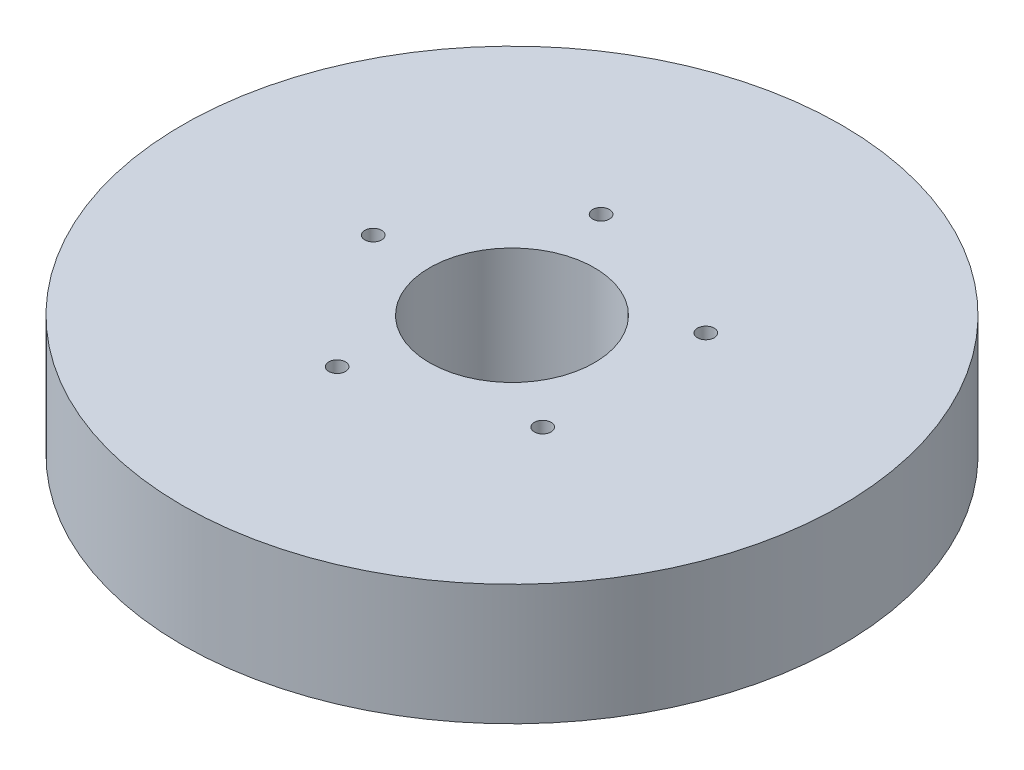
ISO-10303-21;
HEADER;
FILE_DESCRIPTION(('STEP AP214'),'2;1');
FILE_NAME('part.step','',(''),(''),'','','');
FILE_SCHEMA(('AUTOMOTIVE_DESIGN { 1 0 10303 214 1 1 1 1 }'));
ENDSEC;
DATA;
#1=APPLICATION_CONTEXT('core data for automotive mechanical design processes');
#2=APPLICATION_PROTOCOL_DEFINITION('international standard','automotive_design',2000,#1);
#3=PRODUCT_CONTEXT('',#1,'mechanical');
#4=PRODUCT('Part','Part','',(#3));
#5=PRODUCT_RELATED_PRODUCT_CATEGORY('part','',(#4));
#6=PRODUCT_DEFINITION_FORMATION('','',#4);
#7=PRODUCT_DEFINITION_CONTEXT('part definition',#1,'design');
#8=PRODUCT_DEFINITION('design','',#6,#7);
#9=PRODUCT_DEFINITION_SHAPE('','',#8);
#10=(LENGTH_UNIT() NAMED_UNIT(*) SI_UNIT(.MILLI.,.METRE.));
#11=(NAMED_UNIT(*) PLANE_ANGLE_UNIT() SI_UNIT($,.RADIAN.));
#12=(NAMED_UNIT(*) SI_UNIT($,.STERADIAN.) SOLID_ANGLE_UNIT());
#13=UNCERTAINTY_MEASURE_WITH_UNIT(LENGTH_MEASURE(1.E-05),#10,'distance_accuracy_value','');
#14=(GEOMETRIC_REPRESENTATION_CONTEXT(3) GLOBAL_UNCERTAINTY_ASSIGNED_CONTEXT((#13)) GLOBAL_UNIT_ASSIGNED_CONTEXT((#10,
#11,#12)) REPRESENTATION_CONTEXT('',''));
#15=CARTESIAN_POINT('',(0.,0.,0.));
#16=DIRECTION('',(0.,0.,1.));
#17=DIRECTION('',(1.,0.,0.));
#18=AXIS2_PLACEMENT_3D('',#15,#16,#17);
#19=CARTESIAN_POINT('',(0.,22.,0.));
#20=DIRECTION('',(0.,-1.,0.));
#21=DIRECTION('',(0.,0.,-1.));
#22=AXIS2_PLACEMENT_3D('',#19,#20,#21);
#23=CYLINDRICAL_SURFACE('',#22,60.);
#24=CARTESIAN_POINT('',(0.,22.,0.));
#25=DIRECTION('',(0.,1.,0.));
#26=DIRECTION('',(0.,0.,1.));
#27=AXIS2_PLACEMENT_3D('',#24,#25,#26);
#28=CIRCLE('',#27,60.);
#29=CARTESIAN_POINT('',(0.,22.,60.));
#30=VERTEX_POINT('',#29);
#31=EDGE_CURVE('E10',#30,#30,#28,.T.);
#32=ORIENTED_EDGE('',*,*,#31,.F.);
#33=EDGE_LOOP('',(#32));
#34=FACE_BOUND('',#33,.T.);
#35=CARTESIAN_POINT('',(0.,0.,0.));
#36=DIRECTION('',(0.,1.,0.));
#37=DIRECTION('',(0.,0.,1.));
#38=AXIS2_PLACEMENT_3D('',#35,#36,#37);
#39=CIRCLE('',#38,60.);
#40=CARTESIAN_POINT('',(0.,0.,60.));
#41=VERTEX_POINT('',#40);
#42=EDGE_CURVE('E37',#41,#41,#39,.T.);
#43=ORIENTED_EDGE('',*,*,#42,.T.);
#44=EDGE_LOOP('',(#43));
#45=FACE_BOUND('',#44,.T.);
#46=ADVANCED_FACE('F40',(#34,#45),#23,.T.);
#47=CARTESIAN_POINT('',(0.,22.,0.));
#48=DIRECTION('',(0.,1.,0.));
#49=DIRECTION('',(0.,0.,1.));
#50=AXIS2_PLACEMENT_3D('',#47,#48,#49);
#51=PLANE('',#50);
#52=CARTESIAN_POINT('',(-7.80661225066631,22.,24.0262820049866));
#53=DIRECTION('',(0.,1.,0.));
#54=DIRECTION('',(0.951056516295155,0.,0.309016994374945));
#55=AXIS2_PLACEMENT_3D('',#52,#53,#54);
#56=CIRCLE('',#55,1.52617574658441);
#57=CARTESIAN_POINT('',(-6.35513286186558,22.,24.497896247084));
#58=VERTEX_POINT('',#57);
#59=EDGE_CURVE('E78',#58,#58,#56,.T.);
#60=ORIENTED_EDGE('',*,*,#59,.F.);
#61=EDGE_LOOP('',(#60));
#62=FACE_BOUND('',#61,.T.);
#63=CARTESIAN_POINT('',(20.437976209236,22.,14.8490589023716));
#64=DIRECTION('',(0.,1.,0.));
#65=DIRECTION('',(0.587785252292469,0.,-0.809016994374951));
#66=AXIS2_PLACEMENT_3D('',#63,#64,#65);
#67=CIRCLE('',#66,1.52617574658441);
#68=CARTESIAN_POINT('',(21.3350398054847,22.,13.6143567869819));
#69=VERTEX_POINT('',#68);
#70=EDGE_CURVE('E71',#69,#69,#67,.T.);
#71=ORIENTED_EDGE('',*,*,#70,.F.);
#72=EDGE_LOOP('',(#71));
#73=FACE_BOUND('',#72,.T.);
#74=CARTESIAN_POINT('',(20.4379762092358,22.,-14.8490589023718));
#75=DIRECTION('',(0.,1.,0.));
#76=DIRECTION('',(-0.58778525229248,0.,-0.809016994374942));
#77=AXIS2_PLACEMENT_3D('',#74,#75,#76);
#78=CIRCLE('',#77,1.52617574658441);
#79=CARTESIAN_POINT('',(19.540912612987,22.,-16.0837610177615));
#80=VERTEX_POINT('',#79);
#81=EDGE_CURVE('E70',#80,#80,#78,.T.);
#82=ORIENTED_EDGE('',*,*,#81,.F.);
#83=EDGE_LOOP('',(#82));
#84=FACE_BOUND('',#83,.T.);
#85=CARTESIAN_POINT('',(-7.80661225066665,22.,-24.0262820049865));
#86=DIRECTION('',(0.,1.,0.));
#87=DIRECTION('',(-0.95105651629515,0.,0.309016994374958));
#88=AXIS2_PLACEMENT_3D('',#85,#86,#87);
#89=CIRCLE('',#88,1.52617574658441);
#90=CARTESIAN_POINT('',(-9.25809163946737,22.,-23.554667762889));
#91=VERTEX_POINT('',#90);
#92=EDGE_CURVE('E61',#91,#91,#89,.T.);
#93=ORIENTED_EDGE('',*,*,#92,.F.);
#94=EDGE_LOOP('',(#93));
#95=FACE_BOUND('',#94,.T.);
#96=CARTESIAN_POINT('',(-25.262727917139,22.,0.));
#97=DIRECTION('',(0.,1.,0.));
#98=DIRECTION('',(0.,0.,1.));
#99=AXIS2_PLACEMENT_3D('',#96,#97,#98);
#100=CIRCLE('',#99,1.52617574658441);
#101=CARTESIAN_POINT('',(-25.262727917139,22.,1.52617574658441));
#102=VERTEX_POINT('',#101);
#103=EDGE_CURVE('E54',#102,#102,#100,.T.);
#104=ORIENTED_EDGE('',*,*,#103,.F.);
#105=EDGE_LOOP('',(#104));
#106=FACE_BOUND('',#105,.T.);
#107=CARTESIAN_POINT('',(0.,22.,0.));
#108=DIRECTION('',(0.,1.,0.));
#109=DIRECTION('',(0.,0.,1.));
#110=AXIS2_PLACEMENT_3D('',#107,#108,#109);
#111=CIRCLE('',#110,15.);
#112=CARTESIAN_POINT('',(0.,22.,15.));
#113=VERTEX_POINT('',#112);
#114=EDGE_CURVE('E50',#113,#113,#111,.T.);
#115=ORIENTED_EDGE('',*,*,#114,.F.);
#116=EDGE_LOOP('',(#115));
#117=FACE_BOUND('',#116,.T.);
#118=ORIENTED_EDGE('',*,*,#31,.T.);
#119=EDGE_LOOP('',(#118));
#120=FACE_BOUND('',#119,.T.);
#121=ADVANCED_FACE('F94',(#62,#73,#84,#95,#106,#117,#120),#51,.T.);
#122=CARTESIAN_POINT('',(0.,0.,0.));
#123=DIRECTION('',(0.,1.,0.));
#124=DIRECTION('',(0.,0.,1.));
#125=AXIS2_PLACEMENT_3D('',#122,#123,#124);
#126=PLANE('',#125);
#127=CARTESIAN_POINT('',(0.,0.,0.));
#128=DIRECTION('',(0.,1.,0.));
#129=DIRECTION('',(0.,0.,1.));
#130=AXIS2_PLACEMENT_3D('',#127,#128,#129);
#131=CIRCLE('',#130,15.);
#132=CARTESIAN_POINT('',(0.,0.,15.));
#133=VERTEX_POINT('',#132);
#134=EDGE_CURVE('E47',#133,#133,#131,.T.);
#135=ORIENTED_EDGE('',*,*,#134,.T.);
#136=EDGE_LOOP('',(#135));
#137=FACE_BOUND('',#136,.T.);
#138=ORIENTED_EDGE('',*,*,#42,.F.);
#139=EDGE_LOOP('',(#138));
#140=FACE_BOUND('',#139,.T.);
#141=ADVANCED_FACE('F100',(#137,#140),#126,.F.);
#142=CARTESIAN_POINT('',(0.,22.,0.));
#143=DIRECTION('',(0.,-1.,0.));
#144=DIRECTION('',(0.,0.,-1.));
#145=AXIS2_PLACEMENT_3D('',#142,#143,#144);
#146=CYLINDRICAL_SURFACE('',#145,15.);
#147=ORIENTED_EDGE('',*,*,#114,.T.);
#148=EDGE_LOOP('',(#147));
#149=FACE_BOUND('',#148,.T.);
#150=ORIENTED_EDGE('',*,*,#134,.F.);
#151=EDGE_LOOP('',(#150));
#152=FACE_BOUND('',#151,.T.);
#153=ADVANCED_FACE('F108',(#149,#152),#146,.F.);
#154=CARTESIAN_POINT('',(-25.262727917139,8.06643174136733,0.));
#155=DIRECTION('',(0.,1.,0.));
#156=DIRECTION('',(0.,0.,1.));
#157=AXIS2_PLACEMENT_3D('',#154,#155,#156);
#158=CYLINDRICAL_SURFACE('',#157,1.52617574658441);
#159=CARTESIAN_POINT('',(-25.262727917139,8.06643174136733,0.));
#160=DIRECTION('',(0.,1.,0.));
#161=DIRECTION('',(0.,0.,1.));
#162=AXIS2_PLACEMENT_3D('',#159,#160,#161);
#163=CIRCLE('',#162,1.52617574658441);
#164=CARTESIAN_POINT('',(-25.262727917139,8.06643174136733,1.52617574658441));
#165=VERTEX_POINT('',#164);
#166=EDGE_CURVE('E55',#165,#165,#163,.T.);
#167=ORIENTED_EDGE('',*,*,#166,.F.);
#168=EDGE_LOOP('',(#167));
#169=FACE_BOUND('',#168,.T.);
#170=ORIENTED_EDGE('',*,*,#103,.T.);
#171=EDGE_LOOP('',(#170));
#172=FACE_BOUND('',#171,.T.);
#173=ADVANCED_FACE('F115',(#169,#172),#158,.F.);
#174=CARTESIAN_POINT('',(-25.262727917139,8.06643174136733,0.));
#175=DIRECTION('',(0.,1.,0.));
#176=DIRECTION('',(0.,0.,1.));
#177=AXIS2_PLACEMENT_3D('',#174,#175,#176);
#178=PLANE('',#177);
#179=ORIENTED_EDGE('',*,*,#166,.T.);
#180=EDGE_LOOP('',(#179));
#181=FACE_BOUND('',#180,.T.);
#182=ADVANCED_FACE('F142',(#181),#178,.T.);
#183=CARTESIAN_POINT('',(-7.80661225066665,8.06643174136733,-24.0262820049865));
#184=DIRECTION('',(0.,1.,0.));
#185=DIRECTION('',(0.,0.,1.));
#186=AXIS2_PLACEMENT_3D('',#183,#184,#185);
#187=CYLINDRICAL_SURFACE('',#186,1.52617574658441);
#188=CARTESIAN_POINT('',(-7.80661225066665,8.06643174136733,-24.0262820049865));
#189=DIRECTION('',(0.,1.,0.));
#190=DIRECTION('',(-0.95105651629515,0.,0.309016994374958));
#191=AXIS2_PLACEMENT_3D('',#188,#189,#190);
#192=CIRCLE('',#191,1.52617574658441);
#193=CARTESIAN_POINT('',(-9.25809163946737,8.06643174136733,-23.554667762889));
#194=VERTEX_POINT('',#193);
#195=EDGE_CURVE('E63',#194,#194,#192,.T.);
#196=ORIENTED_EDGE('',*,*,#195,.F.);
#197=EDGE_LOOP('',(#196));
#198=FACE_BOUND('',#197,.T.);
#199=ORIENTED_EDGE('',*,*,#92,.T.);
#200=EDGE_LOOP('',(#199));
#201=FACE_BOUND('',#200,.T.);
#202=ADVANCED_FACE('F147',(#198,#201),#187,.F.);
#203=CARTESIAN_POINT('',(-7.80661225066665,8.06643174136733,-24.0262820049865));
#204=DIRECTION('',(0.,1.,0.));
#205=DIRECTION('',(-0.95105651629515,0.,0.309016994374958));
#206=AXIS2_PLACEMENT_3D('',#203,#204,#205);
#207=PLANE('',#206);
#208=ORIENTED_EDGE('',*,*,#195,.T.);
#209=EDGE_LOOP('',(#208));
#210=FACE_BOUND('',#209,.T.);
#211=ADVANCED_FACE('F163',(#210),#207,.T.);
#212=CARTESIAN_POINT('',(20.4379762092358,8.06643174136733,-14.8490589023718));
#213=DIRECTION('',(0.,1.,0.));
#214=DIRECTION('',(0.,0.,1.));
#215=AXIS2_PLACEMENT_3D('',#212,#213,#214);
#216=CYLINDRICAL_SURFACE('',#215,1.52617574658441);
#217=CARTESIAN_POINT('',(20.4379762092358,8.06643174136733,-14.8490589023718));
#218=DIRECTION('',(0.,1.,0.));
#219=DIRECTION('',(-0.58778525229248,0.,-0.809016994374942));
#220=AXIS2_PLACEMENT_3D('',#217,#218,#219);
#221=CIRCLE('',#220,1.52617574658441);
#222=CARTESIAN_POINT('',(19.540912612987,8.06643174136733,-16.0837610177615));
#223=VERTEX_POINT('',#222);
#224=EDGE_CURVE('E69',#223,#223,#221,.T.);
#225=ORIENTED_EDGE('',*,*,#224,.F.);
#226=EDGE_LOOP('',(#225));
#227=FACE_BOUND('',#226,.T.);
#228=ORIENTED_EDGE('',*,*,#81,.T.);
#229=EDGE_LOOP('',(#228));
#230=FACE_BOUND('',#229,.T.);
#231=ADVANCED_FACE('F172',(#227,#230),#216,.F.);
#232=CARTESIAN_POINT('',(20.4379762092358,8.06643174136733,-14.8490589023718));
#233=DIRECTION('',(0.,1.,0.));
#234=DIRECTION('',(-0.58778525229248,0.,-0.809016994374942));
#235=AXIS2_PLACEMENT_3D('',#232,#233,#234);
#236=PLANE('',#235);
#237=ORIENTED_EDGE('',*,*,#224,.T.);
#238=EDGE_LOOP('',(#237));
#239=FACE_BOUND('',#238,.T.);
#240=ADVANCED_FACE('F185',(#239),#236,.T.);
#241=CARTESIAN_POINT('',(20.437976209236,8.06643174136733,14.8490589023716));
#242=DIRECTION('',(0.,1.,0.));
#243=DIRECTION('',(0.,0.,1.));
#244=AXIS2_PLACEMENT_3D('',#241,#242,#243);
#245=CYLINDRICAL_SURFACE('',#244,1.52617574658441);
#246=CARTESIAN_POINT('',(20.437976209236,8.06643174136733,14.8490589023716));
#247=DIRECTION('',(0.,1.,0.));
#248=DIRECTION('',(0.587785252292469,0.,-0.809016994374951));
#249=AXIS2_PLACEMENT_3D('',#246,#247,#248);
#250=CIRCLE('',#249,1.52617574658441);
#251=CARTESIAN_POINT('',(21.3350398054847,8.06643174136733,13.6143567869819));
#252=VERTEX_POINT('',#251);
#253=EDGE_CURVE('E76',#252,#252,#250,.T.);
#254=ORIENTED_EDGE('',*,*,#253,.F.);
#255=EDGE_LOOP('',(#254));
#256=FACE_BOUND('',#255,.T.);
#257=ORIENTED_EDGE('',*,*,#70,.T.);
#258=EDGE_LOOP('',(#257));
#259=FACE_BOUND('',#258,.T.);
#260=ADVANCED_FACE('F191',(#256,#259),#245,.F.);
#261=CARTESIAN_POINT('',(20.437976209236,8.06643174136733,14.8490589023716));
#262=DIRECTION('',(0.,1.,0.));
#263=DIRECTION('',(0.587785252292469,0.,-0.809016994374951));
#264=AXIS2_PLACEMENT_3D('',#261,#262,#263);
#265=PLANE('',#264);
#266=ORIENTED_EDGE('',*,*,#253,.T.);
#267=EDGE_LOOP('',(#266));
#268=FACE_BOUND('',#267,.T.);
#269=ADVANCED_FACE('F89',(#268),#265,.T.);
#270=CARTESIAN_POINT('',(-7.80661225066631,8.06643174136733,24.0262820049866));
#271=DIRECTION('',(0.,1.,0.));
#272=DIRECTION('',(0.,0.,1.));
#273=AXIS2_PLACEMENT_3D('',#270,#271,#272);
#274=CYLINDRICAL_SURFACE('',#273,1.52617574658441);
#275=CARTESIAN_POINT('',(-7.80661225066631,8.06643174136733,24.0262820049866));
#276=DIRECTION('',(0.,1.,0.));
#277=DIRECTION('',(0.951056516295155,0.,0.309016994374945));
#278=AXIS2_PLACEMENT_3D('',#275,#276,#277);
#279=CIRCLE('',#278,1.52617574658441);
#280=CARTESIAN_POINT('',(-6.35513286186558,8.06643174136733,24.497896247084));
#281=VERTEX_POINT('',#280);
#282=EDGE_CURVE('E59',#281,#281,#279,.T.);
#283=ORIENTED_EDGE('',*,*,#282,.F.);
#284=EDGE_LOOP('',(#283));
#285=FACE_BOUND('',#284,.T.);
#286=ORIENTED_EDGE('',*,*,#59,.T.);
#287=EDGE_LOOP('',(#286));
#288=FACE_BOUND('',#287,.T.);
#289=ADVANCED_FACE('F87',(#285,#288),#274,.F.);
#290=CARTESIAN_POINT('',(-7.80661225066631,8.06643174136733,24.0262820049866));
#291=DIRECTION('',(0.,1.,0.));
#292=DIRECTION('',(0.951056516295155,0.,0.309016994374945));
#293=AXIS2_PLACEMENT_3D('',#290,#291,#292);
#294=PLANE('',#293);
#295=ORIENTED_EDGE('',*,*,#282,.T.);
#296=EDGE_LOOP('',(#295));
#297=FACE_BOUND('',#296,.T.);
#298=ADVANCED_FACE('F84',(#297),#294,.T.);
#299=CLOSED_SHELL('',(#46,#121,#141,#153,#173,#182,#202,#211,#231,#240,#260,#269,#289,#298));
#300=MANIFOLD_SOLID_BREP('B2',#299);
#301=ADVANCED_BREP_SHAPE_REPRESENTATION('',(#18,#300),#14);
#302=SHAPE_DEFINITION_REPRESENTATION(#9,#301);
ENDSEC;
END-ISO-10303-21;
